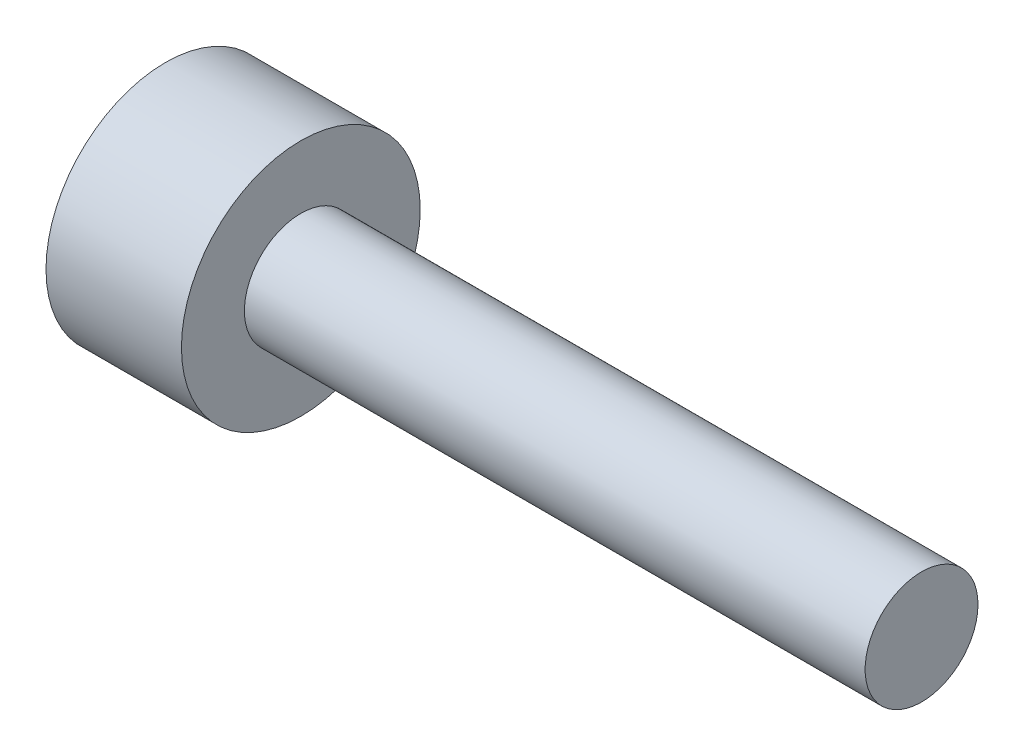
ISO-10303-21;
HEADER;
FILE_DESCRIPTION(('STEP AP214'),'2;1');
FILE_NAME('part.step','',(''),(''),'','','');
FILE_SCHEMA(('AUTOMOTIVE_DESIGN { 1 0 10303 214 1 1 1 1 }'));
ENDSEC;
DATA;
#1=APPLICATION_CONTEXT('core data for automotive mechanical design processes');
#2=APPLICATION_PROTOCOL_DEFINITION('international standard','automotive_design',2000,#1);
#3=PRODUCT_CONTEXT('',#1,'mechanical');
#4=PRODUCT('Part','Part','',(#3));
#5=PRODUCT_RELATED_PRODUCT_CATEGORY('part','',(#4));
#6=PRODUCT_DEFINITION_FORMATION('','',#4);
#7=PRODUCT_DEFINITION_CONTEXT('part definition',#1,'design');
#8=PRODUCT_DEFINITION('design','',#6,#7);
#9=PRODUCT_DEFINITION_SHAPE('','',#8);
#10=(LENGTH_UNIT() NAMED_UNIT(*) SI_UNIT(.MILLI.,.METRE.));
#11=(NAMED_UNIT(*) PLANE_ANGLE_UNIT() SI_UNIT($,.RADIAN.));
#12=(NAMED_UNIT(*) SI_UNIT($,.STERADIAN.) SOLID_ANGLE_UNIT());
#13=UNCERTAINTY_MEASURE_WITH_UNIT(LENGTH_MEASURE(1.E-05),#10,'distance_accuracy_value','');
#14=(GEOMETRIC_REPRESENTATION_CONTEXT(3) GLOBAL_UNCERTAINTY_ASSIGNED_CONTEXT((#13)) GLOBAL_UNIT_ASSIGNED_CONTEXT((#10,
#11,#12)) REPRESENTATION_CONTEXT('',''));
#15=CARTESIAN_POINT('',(0.,0.,0.));
#16=DIRECTION('',(0.,0.,1.));
#17=DIRECTION('',(1.,0.,0.));
#18=AXIS2_PLACEMENT_3D('',#15,#16,#17);
#19=CARTESIAN_POINT('',(-0.1,0.,0.));
#20=DIRECTION('',(-1.,0.,0.));
#21=DIRECTION('',(0.,0.,1.));
#22=AXIS2_PLACEMENT_3D('',#19,#20,#21);
#23=PLANE('',#22);
#24=CARTESIAN_POINT('',(-0.1,0.,0.));
#25=DIRECTION('',(-1.,0.,0.));
#26=DIRECTION('',(0.,0.,1.));
#27=AXIS2_PLACEMENT_3D('',#24,#25,#26);
#28=CIRCLE('',#27,0.18);
#29=CARTESIAN_POINT('',(-0.1,0.,0.18));
#30=VERTEX_POINT('',#29);
#31=CARTESIAN_POINT('',(-0.1,0.155884572681199,0.09));
#32=VERTEX_POINT('',#31);
#33=EDGE_CURVE('E55',#30,#32,#28,.T.);
#34=ORIENTED_EDGE('',*,*,#33,.F.);
#35=DIRECTION('',(0.,1.,0.));
#36=VECTOR('',#35,1.);
#37=CARTESIAN_POINT('',(-0.1,-0.103923048454133,0.18));
#38=LINE('',#37,#36);
#39=CARTESIAN_POINT('',(-0.1,0.103923048454133,0.18));
#40=VERTEX_POINT('',#39);
#41=EDGE_CURVE('E127',#30,#40,#38,.T.);
#42=ORIENTED_EDGE('',*,*,#41,.T.);
#43=DIRECTION('',(0.,0.5,-0.866025403784439));
#44=VECTOR('',#43,1.);
#45=CARTESIAN_POINT('',(-0.1,0.103923048454133,0.18));
#46=LINE('',#45,#44);
#47=EDGE_CURVE('E130',#40,#32,#46,.T.);
#48=ORIENTED_EDGE('',*,*,#47,.T.);
#49=EDGE_LOOP('',(#34,#42,#48));
#50=FACE_BOUND('',#49,.T.);
#51=ADVANCED_FACE('F43',(#50),#23,.T.);
#52=CARTESIAN_POINT('',(-0.1,0.155884572681199,-0.09));
#53=VERTEX_POINT('',#52);
#54=EDGE_CURVE('E11',#32,#53,#28,.T.);
#55=ORIENTED_EDGE('',*,*,#54,.F.);
#56=CARTESIAN_POINT('',(-0.1,0.207846096908265,0.));
#57=VERTEX_POINT('',#56);
#58=EDGE_CURVE('E174',#32,#57,#46,.T.);
#59=ORIENTED_EDGE('',*,*,#58,.T.);
#60=DIRECTION('',(0.,-0.5,-0.866025403784439));
#61=VECTOR('',#60,1.);
#62=CARTESIAN_POINT('',(-0.1,0.207846096908265,0.));
#63=LINE('',#62,#61);
#64=EDGE_CURVE('E279',#57,#53,#63,.T.);
#65=ORIENTED_EDGE('',*,*,#64,.T.);
#66=EDGE_LOOP('',(#55,#59,#65));
#67=FACE_BOUND('',#66,.T.);
#68=ADVANCED_FACE('F225',(#67),#23,.T.);
#69=CARTESIAN_POINT('',(-0.1,0.,-0.18));
#70=VERTEX_POINT('',#69);
#71=EDGE_CURVE('E53',#53,#70,#28,.T.);
#72=ORIENTED_EDGE('',*,*,#71,.F.);
#73=CARTESIAN_POINT('',(-0.1,0.103923048454133,-0.18));
#74=VERTEX_POINT('',#73);
#75=EDGE_CURVE('E283',#53,#74,#63,.T.);
#76=ORIENTED_EDGE('',*,*,#75,.T.);
#77=DIRECTION('',(0.,-1.,0.));
#78=VECTOR('',#77,1.);
#79=CARTESIAN_POINT('',(-0.1,0.103923048454133,-0.18));
#80=LINE('',#79,#78);
#81=EDGE_CURVE('E268',#74,#70,#80,.T.);
#82=ORIENTED_EDGE('',*,*,#81,.T.);
#83=EDGE_LOOP('',(#72,#76,#82));
#84=FACE_BOUND('',#83,.T.);
#85=ADVANCED_FACE('F230',(#84),#23,.T.);
#86=CARTESIAN_POINT('',(-0.1,-0.155884572681199,-0.09));
#87=VERTEX_POINT('',#86);
#88=EDGE_CURVE('E261',#70,#87,#28,.T.);
#89=ORIENTED_EDGE('',*,*,#88,.F.);
#90=CARTESIAN_POINT('',(-0.1,-0.103923048454133,-0.18));
#91=VERTEX_POINT('',#90);
#92=EDGE_CURVE('E271',#70,#91,#80,.T.);
#93=ORIENTED_EDGE('',*,*,#92,.T.);
#94=DIRECTION('',(0.,-0.5,0.866025403784439));
#95=VECTOR('',#94,1.);
#96=CARTESIAN_POINT('',(-0.1,-0.103923048454133,-0.18));
#97=LINE('',#96,#95);
#98=EDGE_CURVE('E266',#91,#87,#97,.T.);
#99=ORIENTED_EDGE('',*,*,#98,.T.);
#100=EDGE_LOOP('',(#89,#93,#99));
#101=FACE_BOUND('',#100,.T.);
#102=ADVANCED_FACE('F247',(#101),#23,.T.);
#103=CARTESIAN_POINT('',(-0.1,-0.155884572681199,0.09));
#104=VERTEX_POINT('',#103);
#105=EDGE_CURVE('E62',#87,#104,#28,.T.);
#106=ORIENTED_EDGE('',*,*,#105,.F.);
#107=CARTESIAN_POINT('',(-0.1,-0.207846096908265,0.));
#108=VERTEX_POINT('',#107);
#109=EDGE_CURVE('E257',#87,#108,#97,.T.);
#110=ORIENTED_EDGE('',*,*,#109,.T.);
#111=DIRECTION('',(0.,0.5,0.866025403784439));
#112=VECTOR('',#111,1.);
#113=CARTESIAN_POINT('',(-0.1,-0.207846096908265,0.));
#114=LINE('',#113,#112);
#115=EDGE_CURVE('E140',#108,#104,#114,.T.);
#116=ORIENTED_EDGE('',*,*,#115,.T.);
#117=EDGE_LOOP('',(#106,#110,#116));
#118=FACE_BOUND('',#117,.T.);
#119=ADVANCED_FACE('F236',(#118),#23,.T.);
#120=CARTESIAN_POINT('',(1.375,0.,0.));
#121=DIRECTION('',(-1.,0.,0.));
#122=DIRECTION('',(0.,0.,1.));
#123=AXIS2_PLACEMENT_3D('',#120,#121,#122);
#124=CYLINDRICAL_SURFACE('',#123,0.125);
#125=CARTESIAN_POINT('',(1.375,0.,0.));
#126=DIRECTION('',(1.,0.,0.));
#127=DIRECTION('',(0.,0.,-1.));
#128=AXIS2_PLACEMENT_3D('',#125,#126,#127);
#129=CIRCLE('',#128,0.125);
#130=CARTESIAN_POINT('',(1.375,0.,-0.125));
#131=VERTEX_POINT('',#130);
#132=EDGE_CURVE('E123',#131,#131,#129,.T.);
#133=ORIENTED_EDGE('',*,*,#132,.F.);
#134=EDGE_LOOP('',(#133));
#135=FACE_BOUND('',#134,.T.);
#136=CARTESIAN_POINT('',(0.,0.,0.));
#137=DIRECTION('',(1.,0.,0.));
#138=DIRECTION('',(0.,0.,-1.));
#139=AXIS2_PLACEMENT_3D('',#136,#137,#138);
#140=CIRCLE('',#139,0.125);
#141=CARTESIAN_POINT('',(0.,0.,-0.125));
#142=VERTEX_POINT('',#141);
#143=EDGE_CURVE('E47',#142,#142,#140,.T.);
#144=ORIENTED_EDGE('',*,*,#143,.T.);
#145=EDGE_LOOP('',(#144));
#146=FACE_BOUND('',#145,.T.);
#147=ADVANCED_FACE('F45',(#135,#146),#124,.T.);
#148=CARTESIAN_POINT('',(1.375,0.,0.));
#149=DIRECTION('',(1.,0.,0.));
#150=DIRECTION('',(0.,0.,-1.));
#151=AXIS2_PLACEMENT_3D('',#148,#149,#150);
#152=PLANE('',#151);
#153=ORIENTED_EDGE('',*,*,#132,.T.);
#154=EDGE_LOOP('',(#153));
#155=FACE_BOUND('',#154,.T.);
#156=ADVANCED_FACE('F214',(#155),#152,.T.);
#157=CARTESIAN_POINT('',(-0.3,0.,0.));
#158=DIRECTION('',(1.,0.,0.));
#159=DIRECTION('',(0.,0.,-1.));
#160=AXIS2_PLACEMENT_3D('',#157,#158,#159);
#161=CYLINDRICAL_SURFACE('',#160,0.264451341471708);
#162=CARTESIAN_POINT('',(-0.3,0.,0.));
#163=DIRECTION('',(-1.,0.,0.));
#164=DIRECTION('',(0.,0.,1.));
#165=AXIS2_PLACEMENT_3D('',#162,#163,#164);
#166=CIRCLE('',#165,0.264451341471708);
#167=CARTESIAN_POINT('',(-0.3,0.,0.264451341471708));
#168=VERTEX_POINT('',#167);
#169=EDGE_CURVE('E189',#168,#168,#166,.T.);
#170=ORIENTED_EDGE('',*,*,#169,.F.);
#171=EDGE_LOOP('',(#170));
#172=FACE_BOUND('',#171,.T.);
#173=CARTESIAN_POINT('',(0.,0.,0.));
#174=DIRECTION('',(-1.,0.,0.));
#175=DIRECTION('',(0.,0.,1.));
#176=AXIS2_PLACEMENT_3D('',#173,#174,#175);
#177=CIRCLE('',#176,0.264451341471708);
#178=CARTESIAN_POINT('',(0.,0.,0.264451341471708));
#179=VERTEX_POINT('',#178);
#180=EDGE_CURVE('E177',#179,#179,#177,.T.);
#181=ORIENTED_EDGE('',*,*,#180,.T.);
#182=EDGE_LOOP('',(#181));
#183=FACE_BOUND('',#182,.T.);
#184=ADVANCED_FACE('F212',(#172,#183),#161,.T.);
#185=CARTESIAN_POINT('',(-0.3,0.,0.));
#186=DIRECTION('',(-1.,0.,0.));
#187=DIRECTION('',(0.,0.,1.));
#188=AXIS2_PLACEMENT_3D('',#185,#186,#187);
#189=PLANE('',#188);
#190=DIRECTION('',(0.,0.5,-0.866025403784439));
#191=VECTOR('',#190,1.);
#192=CARTESIAN_POINT('',(-0.3,0.103923048454133,0.18));
#193=LINE('',#192,#191);
#194=CARTESIAN_POINT('',(-0.3,0.103923048454133,0.18));
#195=VERTEX_POINT('',#194);
#196=CARTESIAN_POINT('',(-0.3,0.207846096908265,0.));
#197=VERTEX_POINT('',#196);
#198=EDGE_CURVE('E70',#195,#197,#193,.T.);
#199=ORIENTED_EDGE('',*,*,#198,.F.);
#200=DIRECTION('',(0.,1.,0.));
#201=VECTOR('',#200,1.);
#202=CARTESIAN_POINT('',(-0.3,-0.103923048454133,0.18));
#203=LINE('',#202,#201);
#204=CARTESIAN_POINT('',(-0.3,-0.103923048454133,0.18));
#205=VERTEX_POINT('',#204);
#206=EDGE_CURVE('E171',#205,#195,#203,.T.);
#207=ORIENTED_EDGE('',*,*,#206,.F.);
#208=DIRECTION('',(0.,0.5,0.866025403784439));
#209=VECTOR('',#208,1.);
#210=CARTESIAN_POINT('',(-0.3,-0.207846096908265,0.));
#211=LINE('',#210,#209);
#212=CARTESIAN_POINT('',(-0.3,-0.207846096908265,0.));
#213=VERTEX_POINT('',#212);
#214=EDGE_CURVE('E167',#213,#205,#211,.T.);
#215=ORIENTED_EDGE('',*,*,#214,.F.);
#216=DIRECTION('',(0.,-0.5,0.866025403784439));
#217=VECTOR('',#216,1.);
#218=CARTESIAN_POINT('',(-0.3,-0.103923048454133,-0.18));
#219=LINE('',#218,#217);
#220=CARTESIAN_POINT('',(-0.3,-0.103923048454133,-0.18));
#221=VERTEX_POINT('',#220);
#222=EDGE_CURVE('E163',#221,#213,#219,.T.);
#223=ORIENTED_EDGE('',*,*,#222,.F.);
#224=DIRECTION('',(0.,-1.,0.));
#225=VECTOR('',#224,1.);
#226=CARTESIAN_POINT('',(-0.3,0.103923048454133,-0.18));
#227=LINE('',#226,#225);
#228=CARTESIAN_POINT('',(-0.3,0.103923048454133,-0.18));
#229=VERTEX_POINT('',#228);
#230=EDGE_CURVE('E159',#229,#221,#227,.T.);
#231=ORIENTED_EDGE('',*,*,#230,.F.);
#232=DIRECTION('',(0.,-0.5,-0.866025403784439));
#233=VECTOR('',#232,1.);
#234=CARTESIAN_POINT('',(-0.3,0.207846096908265,0.));
#235=LINE('',#234,#233);
#236=EDGE_CURVE('E155',#197,#229,#235,.T.);
#237=ORIENTED_EDGE('',*,*,#236,.F.);
#238=EDGE_LOOP('',(#199,#207,#215,#223,#231,#237));
#239=FACE_BOUND('',#238,.T.);
#240=ORIENTED_EDGE('',*,*,#169,.T.);
#241=EDGE_LOOP('',(#240));
#242=FACE_BOUND('',#241,.T.);
#243=ADVANCED_FACE('F208',(#239,#242),#189,.T.);
#244=CARTESIAN_POINT('',(0.,0.,0.));
#245=DIRECTION('',(-1.,0.,0.));
#246=DIRECTION('',(0.,0.,1.));
#247=AXIS2_PLACEMENT_3D('',#244,#245,#246);
#248=PLANE('',#247);
#249=ORIENTED_EDGE('',*,*,#143,.F.);
#250=EDGE_LOOP('',(#249));
#251=FACE_BOUND('',#250,.T.);
#252=ORIENTED_EDGE('',*,*,#180,.F.);
#253=EDGE_LOOP('',(#252));
#254=FACE_BOUND('',#253,.T.);
#255=ADVANCED_FACE('F204',(#251,#254),#248,.F.);
#256=CARTESIAN_POINT('',(-0.1,0.103923048454133,0.18));
#257=DIRECTION('',(0.,0.866025403784439,0.5));
#258=DIRECTION('',(0.,-0.5,0.866025403784439));
#259=AXIS2_PLACEMENT_3D('',#256,#257,#258);
#260=PLANE('',#259);
#261=ORIENTED_EDGE('',*,*,#198,.T.);
#262=DIRECTION('',(-1.,0.,0.));
#263=VECTOR('',#262,1.);
#264=CARTESIAN_POINT('',(-0.1,0.207846096908265,0.));
#265=LINE('',#264,#263);
#266=EDGE_CURVE('E146',#57,#197,#265,.T.);
#267=ORIENTED_EDGE('',*,*,#266,.F.);
#268=ORIENTED_EDGE('',*,*,#58,.F.);
#269=ORIENTED_EDGE('',*,*,#47,.F.);
#270=DIRECTION('',(-1.,0.,0.));
#271=VECTOR('',#270,1.);
#272=CARTESIAN_POINT('',(-0.1,0.103923048454133,0.18));
#273=LINE('',#272,#271);
#274=EDGE_CURVE('E138',#40,#195,#273,.T.);
#275=ORIENTED_EDGE('',*,*,#274,.T.);
#276=EDGE_LOOP('',(#261,#267,#268,#269,#275));
#277=FACE_BOUND('',#276,.T.);
#278=ADVANCED_FACE('F207',(#277),#260,.F.);
#279=CARTESIAN_POINT('',(-0.1,-0.103923048454133,0.18));
#280=DIRECTION('',(0.,0.,1.));
#281=DIRECTION('',(0.,-1.,0.));
#282=AXIS2_PLACEMENT_3D('',#279,#280,#281);
#283=PLANE('',#282);
#284=ORIENTED_EDGE('',*,*,#206,.T.);
#285=ORIENTED_EDGE('',*,*,#274,.F.);
#286=ORIENTED_EDGE('',*,*,#41,.F.);
#287=CARTESIAN_POINT('',(-0.1,-0.103923048454133,0.18));
#288=VERTEX_POINT('',#287);
#289=EDGE_CURVE('E137',#288,#30,#38,.T.);
#290=ORIENTED_EDGE('',*,*,#289,.F.);
#291=DIRECTION('',(-1.,0.,0.));
#292=VECTOR('',#291,1.);
#293=CARTESIAN_POINT('',(-0.1,-0.103923048454133,0.18));
#294=LINE('',#293,#292);
#295=EDGE_CURVE('E178',#288,#205,#294,.T.);
#296=ORIENTED_EDGE('',*,*,#295,.T.);
#297=EDGE_LOOP('',(#284,#285,#286,#290,#296));
#298=FACE_BOUND('',#297,.T.);
#299=ADVANCED_FACE('F136',(#298),#283,.F.);
#300=CARTESIAN_POINT('',(-0.1,-0.207846096908265,0.));
#301=DIRECTION('',(0.,-0.866025403784439,0.5));
#302=DIRECTION('',(0.,-0.5,-0.866025403784439));
#303=AXIS2_PLACEMENT_3D('',#300,#301,#302);
#304=PLANE('',#303);
#305=ORIENTED_EDGE('',*,*,#214,.T.);
#306=ORIENTED_EDGE('',*,*,#295,.F.);
#307=EDGE_CURVE('E143',#104,#288,#114,.T.);
#308=ORIENTED_EDGE('',*,*,#307,.F.);
#309=ORIENTED_EDGE('',*,*,#115,.F.);
#310=DIRECTION('',(-1.,0.,0.));
#311=VECTOR('',#310,1.);
#312=CARTESIAN_POINT('',(-0.1,-0.207846096908265,0.));
#313=LINE('',#312,#311);
#314=EDGE_CURVE('E181',#108,#213,#313,.T.);
#315=ORIENTED_EDGE('',*,*,#314,.T.);
#316=EDGE_LOOP('',(#305,#306,#308,#309,#315));
#317=FACE_BOUND('',#316,.T.);
#318=ADVANCED_FACE('F332',(#317),#304,.F.);
#319=CARTESIAN_POINT('',(-0.1,-0.103923048454133,-0.18));
#320=DIRECTION('',(0.,-0.866025403784439,-0.5));
#321=DIRECTION('',(0.,0.5,-0.866025403784439));
#322=AXIS2_PLACEMENT_3D('',#319,#320,#321);
#323=PLANE('',#322);
#324=ORIENTED_EDGE('',*,*,#222,.T.);
#325=ORIENTED_EDGE('',*,*,#314,.F.);
#326=ORIENTED_EDGE('',*,*,#109,.F.);
#327=ORIENTED_EDGE('',*,*,#98,.F.);
#328=DIRECTION('',(-1.,0.,0.));
#329=VECTOR('',#328,1.);
#330=CARTESIAN_POINT('',(-0.1,-0.103923048454133,-0.18));
#331=LINE('',#330,#329);
#332=EDGE_CURVE('E184',#91,#221,#331,.T.);
#333=ORIENTED_EDGE('',*,*,#332,.T.);
#334=EDGE_LOOP('',(#324,#325,#326,#327,#333));
#335=FACE_BOUND('',#334,.T.);
#336=ADVANCED_FACE('F265',(#335),#323,.F.);
#337=CARTESIAN_POINT('',(-0.1,0.103923048454133,-0.18));
#338=DIRECTION('',(0.,0.,-1.));
#339=DIRECTION('',(0.,1.,0.));
#340=AXIS2_PLACEMENT_3D('',#337,#338,#339);
#341=PLANE('',#340);
#342=ORIENTED_EDGE('',*,*,#230,.T.);
#343=ORIENTED_EDGE('',*,*,#332,.F.);
#344=ORIENTED_EDGE('',*,*,#92,.F.);
#345=ORIENTED_EDGE('',*,*,#81,.F.);
#346=DIRECTION('',(-1.,0.,0.));
#347=VECTOR('',#346,1.);
#348=CARTESIAN_POINT('',(-0.1,0.103923048454133,-0.18));
#349=LINE('',#348,#347);
#350=EDGE_CURVE('E148',#74,#229,#349,.T.);
#351=ORIENTED_EDGE('',*,*,#350,.T.);
#352=EDGE_LOOP('',(#342,#343,#344,#345,#351));
#353=FACE_BOUND('',#352,.T.);
#354=ADVANCED_FACE('F243',(#353),#341,.F.);
#355=CARTESIAN_POINT('',(-0.1,0.207846096908265,0.));
#356=DIRECTION('',(0.,0.866025403784439,-0.5));
#357=DIRECTION('',(0.,0.5,0.866025403784439));
#358=AXIS2_PLACEMENT_3D('',#355,#356,#357);
#359=PLANE('',#358);
#360=ORIENTED_EDGE('',*,*,#236,.T.);
#361=ORIENTED_EDGE('',*,*,#350,.F.);
#362=ORIENTED_EDGE('',*,*,#75,.F.);
#363=ORIENTED_EDGE('',*,*,#64,.F.);
#364=ORIENTED_EDGE('',*,*,#266,.T.);
#365=EDGE_LOOP('',(#360,#361,#362,#363,#364));
#366=FACE_BOUND('',#365,.T.);
#367=ADVANCED_FACE('F235',(#366),#359,.F.);
#368=EDGE_CURVE('E115',#104,#30,#28,.T.);
#369=ORIENTED_EDGE('',*,*,#368,.F.);
#370=ORIENTED_EDGE('',*,*,#307,.T.);
#371=ORIENTED_EDGE('',*,*,#289,.T.);
#372=EDGE_LOOP('',(#369,#370,#371));
#373=FACE_BOUND('',#372,.T.);
#374=ADVANCED_FACE('F142',(#373),#23,.T.);
#375=CARTESIAN_POINT('',(-0.1,0.,0.));
#376=DIRECTION('',(-1.,0.,0.));
#377=DIRECTION('',(0.,0.,1.));
#378=AXIS2_PLACEMENT_3D('',#375,#376,#377);
#379=CONICAL_SURFACE('',#378,0.18,1.0471975511966);
#380=CARTESIAN_POINT('',(0.,0.,0.));
#381=DIRECTION('',(-1.,0.,0.));
#382=DIRECTION('',(0.,0.,1.));
#383=AXIS2_PLACEMENT_3D('',#380,#381,#382);
#384=CIRCLE('',#383,0.00679491924311131);
#385=CARTESIAN_POINT('',(0.,0.,0.00679491924311131));
#386=VERTEX_POINT('',#385);
#387=EDGE_CURVE('E132',#386,#386,#384,.T.);
#388=ORIENTED_EDGE('',*,*,#387,.F.);
#389=EDGE_LOOP('',(#388));
#390=FACE_BOUND('',#389,.T.);
#391=ORIENTED_EDGE('',*,*,#33,.T.);
#392=ORIENTED_EDGE('',*,*,#54,.T.);
#393=ORIENTED_EDGE('',*,*,#71,.T.);
#394=ORIENTED_EDGE('',*,*,#88,.T.);
#395=ORIENTED_EDGE('',*,*,#105,.T.);
#396=ORIENTED_EDGE('',*,*,#368,.T.);
#397=EDGE_LOOP('',(#391,#392,#393,#394,#395,#396));
#398=FACE_BOUND('',#397,.T.);
#399=ADVANCED_FACE('F117',(#390,#398),#379,.F.);
#400=CARTESIAN_POINT('',(0.,0.,0.));
#401=DIRECTION('',(-1.,0.,0.));
#402=DIRECTION('',(0.,0.,1.));
#403=AXIS2_PLACEMENT_3D('',#400,#401,#402);
#404=PLANE('',#403);
#405=ORIENTED_EDGE('',*,*,#387,.T.);
#406=EDGE_LOOP('',(#405));
#407=FACE_BOUND('',#406,.T.);
#408=ADVANCED_FACE('F241',(#407),#404,.T.);
#409=CLOSED_SHELL('',(#51,#68,#85,#102,#119,#147,#156,#184,#243,#255,#278,#299,#318,#336,#354,
#367,#374,#399,#408));
#410=MANIFOLD_SOLID_BREP('B2',#409);
#411=ADVANCED_BREP_SHAPE_REPRESENTATION('',(#18,#410),#14);
#412=SHAPE_DEFINITION_REPRESENTATION(#9,#411);
ENDSEC;
END-ISO-10303-21;
